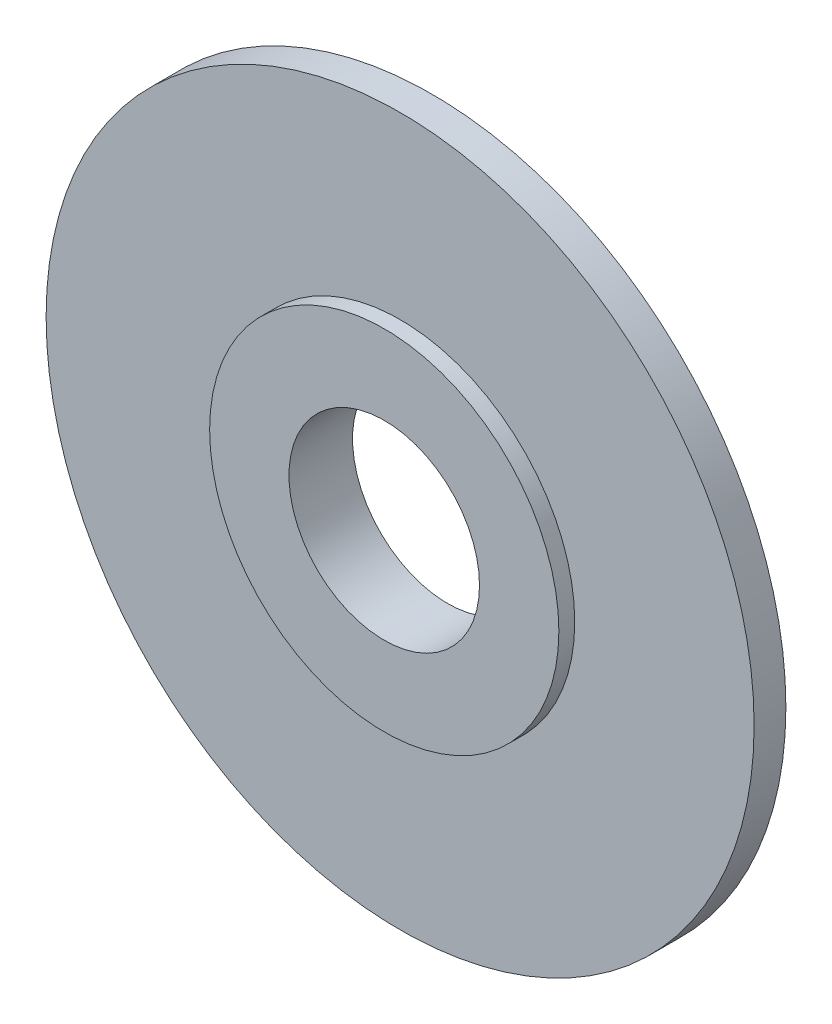
ISO-10303-21;
HEADER;
FILE_DESCRIPTION(('STEP AP214'),'2;1');
FILE_NAME('part.step','',(''),(''),'','','');
FILE_SCHEMA(('AUTOMOTIVE_DESIGN { 1 0 10303 214 1 1 1 1 }'));
ENDSEC;
DATA;
#1=APPLICATION_CONTEXT('core data for automotive mechanical design processes');
#2=APPLICATION_PROTOCOL_DEFINITION('international standard','automotive_design',2000,#1);
#3=PRODUCT_CONTEXT('',#1,'mechanical');
#4=PRODUCT('Part','Part','',(#3));
#5=PRODUCT_RELATED_PRODUCT_CATEGORY('part','',(#4));
#6=PRODUCT_DEFINITION_FORMATION('','',#4);
#7=PRODUCT_DEFINITION_CONTEXT('part definition',#1,'design');
#8=PRODUCT_DEFINITION('design','',#6,#7);
#9=PRODUCT_DEFINITION_SHAPE('','',#8);
#10=(LENGTH_UNIT() NAMED_UNIT(*) SI_UNIT(.MILLI.,.METRE.));
#11=(NAMED_UNIT(*) PLANE_ANGLE_UNIT() SI_UNIT($,.RADIAN.));
#12=(NAMED_UNIT(*) SI_UNIT($,.STERADIAN.) SOLID_ANGLE_UNIT());
#13=UNCERTAINTY_MEASURE_WITH_UNIT(LENGTH_MEASURE(1.E-05),#10,'distance_accuracy_value','');
#14=(GEOMETRIC_REPRESENTATION_CONTEXT(3) GLOBAL_UNCERTAINTY_ASSIGNED_CONTEXT((#13)) GLOBAL_UNIT_ASSIGNED_CONTEXT((#10,
#11,#12)) REPRESENTATION_CONTEXT('',''));
#15=CARTESIAN_POINT('',(0.,0.,0.));
#16=DIRECTION('',(0.,0.,1.));
#17=DIRECTION('',(1.,0.,0.));
#18=AXIS2_PLACEMENT_3D('',#15,#16,#17);
#19=CARTESIAN_POINT('',(0.,0.,10.));
#20=DIRECTION('',(0.,0.,-1.));
#21=DIRECTION('',(-1.,0.,0.));
#22=AXIS2_PLACEMENT_3D('',#19,#20,#21);
#23=CYLINDRICAL_SURFACE('',#22,27.5);
#24=CARTESIAN_POINT('',(0.,0.,0.));
#25=DIRECTION('',(0.,0.,1.));
#26=DIRECTION('',(1.,0.,0.));
#27=AXIS2_PLACEMENT_3D('',#24,#25,#26);
#28=CIRCLE('',#27,27.5);
#29=CARTESIAN_POINT('',(27.5,0.,0.));
#30=VERTEX_POINT('',#29);
#31=EDGE_CURVE('E50',#30,#30,#28,.T.);
#32=ORIENTED_EDGE('',*,*,#31,.T.);
#33=EDGE_LOOP('',(#32));
#34=FACE_BOUND('',#33,.T.);
#35=CARTESIAN_POINT('',(0.,0.,2.5));
#36=DIRECTION('',(0.,0.,1.));
#37=DIRECTION('',(1.,0.,0.));
#38=AXIS2_PLACEMENT_3D('',#35,#36,#37);
#39=CIRCLE('',#38,27.5);
#40=CARTESIAN_POINT('',(27.5,0.,2.5));
#41=VERTEX_POINT('',#40);
#42=EDGE_CURVE('E10',#41,#41,#39,.T.);
#43=ORIENTED_EDGE('',*,*,#42,.F.);
#44=EDGE_LOOP('',(#43));
#45=FACE_BOUND('',#44,.T.);
#46=ADVANCED_FACE('F37',(#34,#45),#23,.T.);
#47=CARTESIAN_POINT('',(0.,0.,10.));
#48=DIRECTION('',(0.,0.,1.));
#49=DIRECTION('',(1.,0.,0.));
#50=AXIS2_PLACEMENT_3D('',#47,#48,#49);
#51=PLANE('',#50);
#52=CARTESIAN_POINT('',(0.,0.,10.));
#53=DIRECTION('',(0.,0.,1.));
#54=DIRECTION('',(1.,0.,0.));
#55=AXIS2_PLACEMENT_3D('',#52,#53,#54);
#56=CIRCLE('',#55,27.5);
#57=CARTESIAN_POINT('',(27.5,0.,10.));
#58=VERTEX_POINT('',#57);
#59=EDGE_CURVE('E45',#58,#58,#56,.T.);
#60=ORIENTED_EDGE('',*,*,#59,.T.);
#61=EDGE_LOOP('',(#60));
#62=FACE_BOUND('',#61,.T.);
#63=CARTESIAN_POINT('',(0.,0.,10.));
#64=DIRECTION('',(0.,0.,1.));
#65=DIRECTION('',(1.,0.,0.));
#66=AXIS2_PLACEMENT_3D('',#63,#64,#65);
#67=CIRCLE('',#66,15.);
#68=CARTESIAN_POINT('',(15.,0.,10.));
#69=VERTEX_POINT('',#68);
#70=EDGE_CURVE('E56',#69,#69,#67,.T.);
#71=ORIENTED_EDGE('',*,*,#70,.F.);
#72=EDGE_LOOP('',(#71));
#73=FACE_BOUND('',#72,.T.);
#74=ADVANCED_FACE('F91',(#62,#73),#51,.T.);
#75=CARTESIAN_POINT('',(0.,0.,0.));
#76=DIRECTION('',(0.,0.,1.));
#77=DIRECTION('',(1.,0.,0.));
#78=AXIS2_PLACEMENT_3D('',#75,#76,#77);
#79=PLANE('',#78);
#80=ORIENTED_EDGE('',*,*,#31,.F.);
#81=EDGE_LOOP('',(#80));
#82=FACE_BOUND('',#81,.T.);
#83=CARTESIAN_POINT('',(0.,0.,0.));
#84=DIRECTION('',(0.,0.,1.));
#85=DIRECTION('',(1.,0.,0.));
#86=AXIS2_PLACEMENT_3D('',#83,#84,#85);
#87=CIRCLE('',#86,15.);
#88=CARTESIAN_POINT('',(15.,0.,0.));
#89=VERTEX_POINT('',#88);
#90=EDGE_CURVE('E58',#89,#89,#87,.T.);
#91=ORIENTED_EDGE('',*,*,#90,.T.);
#92=EDGE_LOOP('',(#91));
#93=FACE_BOUND('',#92,.T.);
#94=ADVANCED_FACE('F96',(#82,#93),#79,.F.);
#95=CARTESIAN_POINT('',(0.,0.,7.5));
#96=DIRECTION('',(0.,0.,1.));
#97=DIRECTION('',(1.,0.,0.));
#98=AXIS2_PLACEMENT_3D('',#95,#96,#97);
#99=CIRCLE('',#98,27.5);
#100=CARTESIAN_POINT('',(27.5,0.,7.5));
#101=VERTEX_POINT('',#100);
#102=EDGE_CURVE('E73',#101,#101,#99,.T.);
#103=ORIENTED_EDGE('',*,*,#102,.T.);
#104=EDGE_LOOP('',(#103));
#105=FACE_BOUND('',#104,.T.);
#106=ORIENTED_EDGE('',*,*,#59,.F.);
#107=EDGE_LOOP('',(#106));
#108=FACE_BOUND('',#107,.T.);
#109=ADVANCED_FACE('F39',(#105,#108),#23,.T.);
#110=CARTESIAN_POINT('',(0.,0.,10.));
#111=DIRECTION('',(0.,0.,-1.));
#112=DIRECTION('',(-1.,0.,0.));
#113=AXIS2_PLACEMENT_3D('',#110,#111,#112);
#114=CYLINDRICAL_SURFACE('',#113,15.);
#115=ORIENTED_EDGE('',*,*,#70,.T.);
#116=EDGE_LOOP('',(#115));
#117=FACE_BOUND('',#116,.T.);
#118=ORIENTED_EDGE('',*,*,#90,.F.);
#119=EDGE_LOOP('',(#118));
#120=FACE_BOUND('',#119,.T.);
#121=ADVANCED_FACE('F100',(#117,#120),#114,.F.);
#122=CARTESIAN_POINT('',(0.,0.,2.5));
#123=DIRECTION('',(0.,0.,1.));
#124=DIRECTION('',(1.,0.,0.));
#125=AXIS2_PLACEMENT_3D('',#122,#123,#124);
#126=CYLINDRICAL_SURFACE('',#125,55.75);
#127=CARTESIAN_POINT('',(0.,0.,2.5));
#128=DIRECTION('',(0.,0.,1.));
#129=DIRECTION('',(1.,0.,0.));
#130=AXIS2_PLACEMENT_3D('',#127,#128,#129);
#131=CIRCLE('',#130,55.75);
#132=CARTESIAN_POINT('',(55.75,0.,2.5));
#133=VERTEX_POINT('',#132);
#134=EDGE_CURVE('E62',#133,#133,#131,.T.);
#135=ORIENTED_EDGE('',*,*,#134,.T.);
#136=EDGE_LOOP('',(#135));
#137=FACE_BOUND('',#136,.T.);
#138=CARTESIAN_POINT('',(0.,0.,7.5));
#139=DIRECTION('',(0.,0.,1.));
#140=DIRECTION('',(1.,0.,0.));
#141=AXIS2_PLACEMENT_3D('',#138,#139,#140);
#142=CIRCLE('',#141,55.75);
#143=CARTESIAN_POINT('',(55.75,0.,7.5));
#144=VERTEX_POINT('',#143);
#145=EDGE_CURVE('E69',#144,#144,#142,.T.);
#146=ORIENTED_EDGE('',*,*,#145,.F.);
#147=EDGE_LOOP('',(#146));
#148=FACE_BOUND('',#147,.T.);
#149=ADVANCED_FACE('F88',(#137,#148),#126,.T.);
#150=CARTESIAN_POINT('',(0.,0.,2.5));
#151=DIRECTION('',(0.,0.,1.));
#152=DIRECTION('',(1.,0.,0.));
#153=AXIS2_PLACEMENT_3D('',#150,#151,#152);
#154=PLANE('',#153);
#155=ORIENTED_EDGE('',*,*,#42,.T.);
#156=EDGE_LOOP('',(#155));
#157=FACE_BOUND('',#156,.T.);
#158=ORIENTED_EDGE('',*,*,#134,.F.);
#159=EDGE_LOOP('',(#158));
#160=FACE_BOUND('',#159,.T.);
#161=ADVANCED_FACE('F82',(#157,#160),#154,.F.);
#162=CARTESIAN_POINT('',(0.,0.,7.5));
#163=DIRECTION('',(0.,0.,1.));
#164=DIRECTION('',(1.,0.,0.));
#165=AXIS2_PLACEMENT_3D('',#162,#163,#164);
#166=PLANE('',#165);
#167=ORIENTED_EDGE('',*,*,#145,.T.);
#168=EDGE_LOOP('',(#167));
#169=FACE_BOUND('',#168,.T.);
#170=ORIENTED_EDGE('',*,*,#102,.F.);
#171=EDGE_LOOP('',(#170));
#172=FACE_BOUND('',#171,.T.);
#173=ADVANCED_FACE('F80',(#169,#172),#166,.T.);
#174=CLOSED_SHELL('',(#46,#74,#94,#109,#121,#149,#161,#173));
#175=MANIFOLD_SOLID_BREP('B2',#174);
#176=ADVANCED_BREP_SHAPE_REPRESENTATION('',(#18,#175),#14);
#177=SHAPE_DEFINITION_REPRESENTATION(#9,#176);
ENDSEC;
END-ISO-10303-21;
